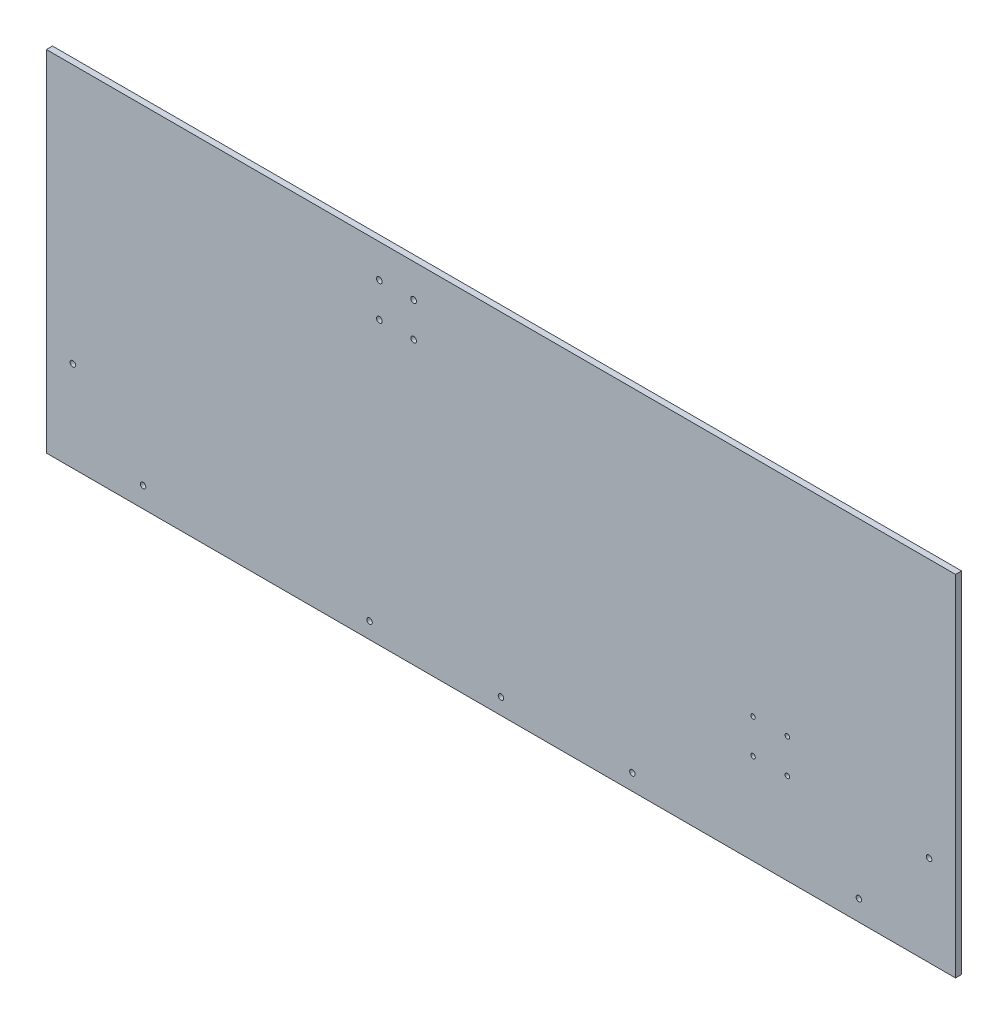
ISO-10303-21;
HEADER;
FILE_DESCRIPTION(('STEP AP214'),'2;1');
FILE_NAME('part.step','',(''),(''),'','','');
FILE_SCHEMA(('AUTOMOTIVE_DESIGN { 1 0 10303 214 1 1 1 1 }'));
ENDSEC;
DATA;
#1=APPLICATION_CONTEXT('core data for automotive mechanical design processes');
#2=APPLICATION_PROTOCOL_DEFINITION('international standard','automotive_design',2000,#1);
#3=PRODUCT_CONTEXT('',#1,'mechanical');
#4=PRODUCT('Part','Part','',(#3));
#5=PRODUCT_RELATED_PRODUCT_CATEGORY('part','',(#4));
#6=PRODUCT_DEFINITION_FORMATION('','',#4);
#7=PRODUCT_DEFINITION_CONTEXT('part definition',#1,'design');
#8=PRODUCT_DEFINITION('design','',#6,#7);
#9=PRODUCT_DEFINITION_SHAPE('','',#8);
#10=(LENGTH_UNIT() NAMED_UNIT(*) SI_UNIT(.MILLI.,.METRE.));
#11=(NAMED_UNIT(*) PLANE_ANGLE_UNIT() SI_UNIT($,.RADIAN.));
#12=(NAMED_UNIT(*) SI_UNIT($,.STERADIAN.) SOLID_ANGLE_UNIT());
#13=UNCERTAINTY_MEASURE_WITH_UNIT(LENGTH_MEASURE(1.E-05),#10,'distance_accuracy_value','');
#14=(GEOMETRIC_REPRESENTATION_CONTEXT(3) GLOBAL_UNCERTAINTY_ASSIGNED_CONTEXT((#13)) GLOBAL_UNIT_ASSIGNED_CONTEXT((#10,
#11,#12)) REPRESENTATION_CONTEXT('',''));
#15=CARTESIAN_POINT('',(0.,0.,0.));
#16=DIRECTION('',(0.,0.,1.));
#17=DIRECTION('',(1.,0.,0.));
#18=AXIS2_PLACEMENT_3D('',#15,#16,#17);
#19=CARTESIAN_POINT('',(357.1875,-137.31875,4.7625));
#20=DIRECTION('',(-1.,0.,0.));
#21=DIRECTION('',(0.,0.,1.));
#22=AXIS2_PLACEMENT_3D('',#19,#20,#21);
#23=PLANE('',#22);
#24=DIRECTION('',(0.,1.,0.));
#25=VECTOR('',#24,1.);
#26=CARTESIAN_POINT('',(357.1875,-137.31875,0.));
#27=LINE('',#26,#25);
#28=CARTESIAN_POINT('',(357.1875,-137.31875,0.));
#29=VERTEX_POINT('',#28);
#30=CARTESIAN_POINT('',(357.1875,137.31875,0.));
#31=VERTEX_POINT('',#30);
#32=EDGE_CURVE('E98',#29,#31,#27,.T.);
#33=ORIENTED_EDGE('',*,*,#32,.T.);
#34=DIRECTION('',(0.,0.,-1.));
#35=VECTOR('',#34,1.);
#36=CARTESIAN_POINT('',(357.1875,137.31875,4.7625));
#37=LINE('',#36,#35);
#38=CARTESIAN_POINT('',(357.1875,137.31875,4.7625));
#39=VERTEX_POINT('',#38);
#40=EDGE_CURVE('E11',#39,#31,#37,.T.);
#41=ORIENTED_EDGE('',*,*,#40,.F.);
#42=DIRECTION('',(0.,1.,0.));
#43=VECTOR('',#42,1.);
#44=CARTESIAN_POINT('',(357.1875,-137.31875,4.7625));
#45=LINE('',#44,#43);
#46=CARTESIAN_POINT('',(357.1875,-137.31875,4.7625));
#47=VERTEX_POINT('',#46);
#48=EDGE_CURVE('E85',#47,#39,#45,.T.);
#49=ORIENTED_EDGE('',*,*,#48,.F.);
#50=DIRECTION('',(0.,0.,-1.));
#51=VECTOR('',#50,1.);
#52=CARTESIAN_POINT('',(357.1875,-137.31875,4.7625));
#53=LINE('',#52,#51);
#54=EDGE_CURVE('E94',#47,#29,#53,.T.);
#55=ORIENTED_EDGE('',*,*,#54,.T.);
#56=EDGE_LOOP('',(#33,#41,#49,#55));
#57=FACE_BOUND('',#56,.T.);
#58=ADVANCED_FACE('F32',(#57),#23,.F.);
#59=CARTESIAN_POINT('',(-357.1875,137.31875,4.7625));
#60=DIRECTION('',(0.,-1.,0.));
#61=DIRECTION('',(0.,0.,-1.));
#62=AXIS2_PLACEMENT_3D('',#59,#60,#61);
#63=PLANE('',#62);
#64=DIRECTION('',(-1.,0.,0.));
#65=VECTOR('',#64,1.);
#66=CARTESIAN_POINT('',(-357.1875,137.31875,0.));
#67=LINE('',#66,#65);
#68=CARTESIAN_POINT('',(-357.1875,137.31875,0.));
#69=VERTEX_POINT('',#68);
#70=EDGE_CURVE('E89',#31,#69,#67,.T.);
#71=ORIENTED_EDGE('',*,*,#70,.T.);
#72=DIRECTION('',(0.,0.,-1.));
#73=VECTOR('',#72,1.);
#74=CARTESIAN_POINT('',(-357.1875,137.31875,4.7625));
#75=LINE('',#74,#73);
#76=CARTESIAN_POINT('',(-357.1875,137.31875,4.7625));
#77=VERTEX_POINT('',#76);
#78=EDGE_CURVE('E41',#77,#69,#75,.T.);
#79=ORIENTED_EDGE('',*,*,#78,.F.);
#80=DIRECTION('',(-1.,0.,0.));
#81=VECTOR('',#80,1.);
#82=CARTESIAN_POINT('',(-357.1875,137.31875,4.7625));
#83=LINE('',#82,#81);
#84=EDGE_CURVE('E80',#39,#77,#83,.T.);
#85=ORIENTED_EDGE('',*,*,#84,.F.);
#86=ORIENTED_EDGE('',*,*,#40,.T.);
#87=EDGE_LOOP('',(#71,#79,#85,#86));
#88=FACE_BOUND('',#87,.T.);
#89=ADVANCED_FACE('F88',(#88),#63,.F.);
#90=CARTESIAN_POINT('',(-357.1875,-137.31875,4.7625));
#91=DIRECTION('',(1.,0.,0.));
#92=DIRECTION('',(0.,0.,-1.));
#93=AXIS2_PLACEMENT_3D('',#90,#91,#92);
#94=PLANE('',#93);
#95=DIRECTION('',(0.,-1.,0.));
#96=VECTOR('',#95,1.);
#97=CARTESIAN_POINT('',(-357.1875,-137.31875,0.));
#98=LINE('',#97,#96);
#99=CARTESIAN_POINT('',(-357.1875,-137.31875,0.));
#100=VERTEX_POINT('',#99);
#101=EDGE_CURVE('E67',#69,#100,#98,.T.);
#102=ORIENTED_EDGE('',*,*,#101,.T.);
#103=DIRECTION('',(0.,0.,-1.));
#104=VECTOR('',#103,1.);
#105=CARTESIAN_POINT('',(-357.1875,-137.31875,4.7625));
#106=LINE('',#105,#104);
#107=CARTESIAN_POINT('',(-357.1875,-137.31875,4.7625));
#108=VERTEX_POINT('',#107);
#109=EDGE_CURVE('E90',#108,#100,#106,.T.);
#110=ORIENTED_EDGE('',*,*,#109,.F.);
#111=DIRECTION('',(0.,-1.,0.));
#112=VECTOR('',#111,1.);
#113=CARTESIAN_POINT('',(-357.1875,-137.31875,4.7625));
#114=LINE('',#113,#112);
#115=EDGE_CURVE('E83',#77,#108,#114,.T.);
#116=ORIENTED_EDGE('',*,*,#115,.F.);
#117=ORIENTED_EDGE('',*,*,#78,.T.);
#118=EDGE_LOOP('',(#102,#110,#116,#117));
#119=FACE_BOUND('',#118,.T.);
#120=ADVANCED_FACE('F92',(#119),#94,.F.);
#121=CARTESIAN_POINT('',(-357.1875,-137.31875,4.7625));
#122=DIRECTION('',(0.,1.,0.));
#123=DIRECTION('',(0.,0.,1.));
#124=AXIS2_PLACEMENT_3D('',#121,#122,#123);
#125=PLANE('',#124);
#126=DIRECTION('',(1.,0.,0.));
#127=VECTOR('',#126,1.);
#128=CARTESIAN_POINT('',(-357.1875,-137.31875,0.));
#129=LINE('',#128,#127);
#130=EDGE_CURVE('E73',#100,#29,#129,.T.);
#131=ORIENTED_EDGE('',*,*,#130,.T.);
#132=ORIENTED_EDGE('',*,*,#54,.F.);
#133=DIRECTION('',(1.,0.,0.));
#134=VECTOR('',#133,1.);
#135=CARTESIAN_POINT('',(-357.1875,-137.31875,4.7625));
#136=LINE('',#135,#134);
#137=EDGE_CURVE('E50',#108,#47,#136,.T.);
#138=ORIENTED_EDGE('',*,*,#137,.F.);
#139=ORIENTED_EDGE('',*,*,#109,.T.);
#140=EDGE_LOOP('',(#131,#132,#138,#139));
#141=FACE_BOUND('',#140,.T.);
#142=ADVANCED_FACE('F178',(#141),#125,.F.);
#143=CARTESIAN_POINT('',(0.,0.,4.7625));
#144=DIRECTION('',(0.,0.,-1.));
#145=DIRECTION('',(-1.,0.,0.));
#146=AXIS2_PLACEMENT_3D('',#143,#144,#145);
#147=PLANE('',#146);
#148=CARTESIAN_POINT('',(198.048115818396,-65.8896341816041,4.7625));
#149=DIRECTION('',(0.,0.,1.));
#150=DIRECTION('',(1.,0.,0.));
#151=AXIS2_PLACEMENT_3D('',#148,#149,#150);
#152=CIRCLE('',#151,1.77799999999998);
#153=CARTESIAN_POINT('',(199.826115818396,-65.8896341816041,4.7625));
#154=VERTEX_POINT('',#153);
#155=EDGE_CURVE('E368',#154,#154,#152,.T.);
#156=ORIENTED_EDGE('',*,*,#155,.F.);
#157=EDGE_LOOP('',(#156));
#158=FACE_BOUND('',#157,.T.);
#159=CARTESIAN_POINT('',(224.988884181604,-65.8896341816041,4.7625));
#160=DIRECTION('',(0.,0.,1.));
#161=DIRECTION('',(1.,0.,0.));
#162=AXIS2_PLACEMENT_3D('',#159,#160,#161);
#163=CIRCLE('',#162,1.778);
#164=CARTESIAN_POINT('',(226.766884181604,-65.8896341816041,4.7625));
#165=VERTEX_POINT('',#164);
#166=EDGE_CURVE('E370',#165,#165,#163,.T.);
#167=ORIENTED_EDGE('',*,*,#166,.F.);
#168=EDGE_LOOP('',(#167));
#169=FACE_BOUND('',#168,.T.);
#170=CARTESIAN_POINT('',(224.988884181604,-38.9488658183966,4.7625));
#171=DIRECTION('',(0.,0.,1.));
#172=DIRECTION('',(1.,0.,0.));
#173=AXIS2_PLACEMENT_3D('',#170,#171,#172);
#174=CIRCLE('',#173,1.778);
#175=CARTESIAN_POINT('',(226.766884181604,-38.9488658183966,4.7625));
#176=VERTEX_POINT('',#175);
#177=EDGE_CURVE('E376',#176,#176,#174,.T.);
#178=ORIENTED_EDGE('',*,*,#177,.F.);
#179=EDGE_LOOP('',(#178));
#180=FACE_BOUND('',#179,.T.);
#181=CARTESIAN_POINT('',(198.048115818396,-38.9488658183968,4.7625));
#182=DIRECTION('',(0.,0.,1.));
#183=DIRECTION('',(1.,0.,0.));
#184=AXIS2_PLACEMENT_3D('',#181,#182,#183);
#185=CIRCLE('',#184,1.77799999999998);
#186=CARTESIAN_POINT('',(199.826115818396,-38.9488658183968,4.7625));
#187=VERTEX_POINT('',#186);
#188=EDGE_CURVE('E382',#187,#187,#185,.T.);
#189=ORIENTED_EDGE('',*,*,#188,.F.);
#190=EDGE_LOOP('',(#189));
#191=FACE_BOUND('',#190,.T.);
#192=CARTESIAN_POINT('',(-95.5675,111.15675,4.7625));
#193=DIRECTION('',(0.,0.,1.));
#194=DIRECTION('',(1.,0.,0.));
#195=AXIS2_PLACEMENT_3D('',#192,#193,#194);
#196=CIRCLE('',#195,2.2479);
#197=CARTESIAN_POINT('',(-93.3196,111.15675,4.7625));
#198=VERTEX_POINT('',#197);
#199=EDGE_CURVE('E388',#198,#198,#196,.T.);
#200=ORIENTED_EDGE('',*,*,#199,.F.);
#201=EDGE_LOOP('',(#200));
#202=FACE_BOUND('',#201,.T.);
#203=CARTESIAN_POINT('',(-68.6435,111.15675,4.7625));
#204=DIRECTION('',(0.,0.,1.));
#205=DIRECTION('',(1.,0.,0.));
#206=AXIS2_PLACEMENT_3D('',#203,#204,#205);
#207=CIRCLE('',#206,2.2479);
#208=CARTESIAN_POINT('',(-66.3956,111.15675,4.7625));
#209=VERTEX_POINT('',#208);
#210=EDGE_CURVE('E133',#209,#209,#207,.T.);
#211=ORIENTED_EDGE('',*,*,#210,.F.);
#212=EDGE_LOOP('',(#211));
#213=FACE_BOUND('',#212,.T.);
#214=CARTESIAN_POINT('',(-95.5675,84.23275,4.7625));
#215=DIRECTION('',(0.,0.,1.));
#216=DIRECTION('',(1.,0.,0.));
#217=AXIS2_PLACEMENT_3D('',#214,#215,#216);
#218=CIRCLE('',#217,2.2479);
#219=CARTESIAN_POINT('',(-93.3196,84.23275,4.7625));
#220=VERTEX_POINT('',#219);
#221=EDGE_CURVE('E122',#220,#220,#218,.T.);
#222=ORIENTED_EDGE('',*,*,#221,.F.);
#223=EDGE_LOOP('',(#222));
#224=FACE_BOUND('',#223,.T.);
#225=CARTESIAN_POINT('',(-68.6435,84.23275,4.7625));
#226=DIRECTION('',(0.,0.,1.));
#227=DIRECTION('',(1.,0.,0.));
#228=AXIS2_PLACEMENT_3D('',#225,#226,#227);
#229=CIRCLE('',#228,2.2479);
#230=CARTESIAN_POINT('',(-66.3956,84.23275,4.7625));
#231=VERTEX_POINT('',#230);
#232=EDGE_CURVE('E121',#231,#231,#229,.T.);
#233=ORIENTED_EDGE('',*,*,#232,.F.);
#234=EDGE_LOOP('',(#233));
#235=FACE_BOUND('',#234,.T.);
#236=CARTESIAN_POINT('',(-103.251,-124.61875,4.7625));
#237=DIRECTION('',(0.,0.,1.));
#238=DIRECTION('',(1.,0.,0.));
#239=AXIS2_PLACEMENT_3D('',#236,#237,#238);
#240=CIRCLE('',#239,2.15264999999999);
#241=CARTESIAN_POINT('',(-101.09835,-124.61875,4.7625));
#242=VERTEX_POINT('',#241);
#243=EDGE_CURVE('E139',#242,#242,#240,.T.);
#244=ORIENTED_EDGE('',*,*,#243,.F.);
#245=EDGE_LOOP('',(#244));
#246=FACE_BOUND('',#245,.T.);
#247=CARTESIAN_POINT('',(0.,-124.61875,4.7625));
#248=DIRECTION('',(0.,0.,1.));
#249=DIRECTION('',(1.,0.,0.));
#250=AXIS2_PLACEMENT_3D('',#247,#248,#249);
#251=CIRCLE('',#250,2.15264999999999);
#252=CARTESIAN_POINT('',(2.15264999999999,-124.61875,4.7625));
#253=VERTEX_POINT('',#252);
#254=EDGE_CURVE('E145',#253,#253,#251,.T.);
#255=ORIENTED_EDGE('',*,*,#254,.F.);
#256=EDGE_LOOP('',(#255));
#257=FACE_BOUND('',#256,.T.);
#258=CARTESIAN_POINT('',(103.251,-124.61875,4.7625));
#259=DIRECTION('',(0.,0.,1.));
#260=DIRECTION('',(1.,0.,0.));
#261=AXIS2_PLACEMENT_3D('',#258,#259,#260);
#262=CIRCLE('',#261,2.15264999999999);
#263=CARTESIAN_POINT('',(105.40365,-124.61875,4.7625));
#264=VERTEX_POINT('',#263);
#265=EDGE_CURVE('E151',#264,#264,#262,.T.);
#266=ORIENTED_EDGE('',*,*,#265,.F.);
#267=EDGE_LOOP('',(#266));
#268=FACE_BOUND('',#267,.T.);
#269=CARTESIAN_POINT('',(-336.41538,-66.13271,4.7625));
#270=DIRECTION('',(0.,0.,1.));
#271=DIRECTION('',(1.,0.,0.));
#272=AXIS2_PLACEMENT_3D('',#269,#270,#271);
#273=CIRCLE('',#272,2.15264999999998);
#274=CARTESIAN_POINT('',(-334.26273,-66.13271,4.7625));
#275=VERTEX_POINT('',#274);
#276=EDGE_CURVE('E118',#275,#275,#273,.T.);
#277=ORIENTED_EDGE('',*,*,#276,.F.);
#278=EDGE_LOOP('',(#277));
#279=FACE_BOUND('',#278,.T.);
#280=CARTESIAN_POINT('',(-281.23896,-121.30913,4.7625));
#281=DIRECTION('',(0.,0.,1.));
#282=DIRECTION('',(1.,0.,0.));
#283=AXIS2_PLACEMENT_3D('',#280,#281,#282);
#284=CIRCLE('',#283,2.15264999999998);
#285=CARTESIAN_POINT('',(-279.08631,-121.30913,4.7625));
#286=VERTEX_POINT('',#285);
#287=EDGE_CURVE('E115',#286,#286,#284,.T.);
#288=ORIENTED_EDGE('',*,*,#287,.F.);
#289=EDGE_LOOP('',(#288));
#290=FACE_BOUND('',#289,.T.);
#291=CARTESIAN_POINT('',(281.23896,-121.30913,4.7625));
#292=DIRECTION('',(0.,0.,1.));
#293=DIRECTION('',(1.,0.,0.));
#294=AXIS2_PLACEMENT_3D('',#291,#292,#293);
#295=CIRCLE('',#294,2.15264999999998);
#296=CARTESIAN_POINT('',(283.39161,-121.30913,4.7625));
#297=VERTEX_POINT('',#296);
#298=EDGE_CURVE('E111',#297,#297,#295,.T.);
#299=ORIENTED_EDGE('',*,*,#298,.F.);
#300=EDGE_LOOP('',(#299));
#301=FACE_BOUND('',#300,.T.);
#302=CARTESIAN_POINT('',(336.41538,-66.13271,4.7625));
#303=DIRECTION('',(0.,0.,1.));
#304=DIRECTION('',(1.,0.,0.));
#305=AXIS2_PLACEMENT_3D('',#302,#303,#304);
#306=CIRCLE('',#305,2.15264999999998);
#307=CARTESIAN_POINT('',(338.56803,-66.13271,4.7625));
#308=VERTEX_POINT('',#307);
#309=EDGE_CURVE('E110',#308,#308,#306,.T.);
#310=ORIENTED_EDGE('',*,*,#309,.F.);
#311=EDGE_LOOP('',(#310));
#312=FACE_BOUND('',#311,.T.);
#313=ORIENTED_EDGE('',*,*,#48,.T.);
#314=ORIENTED_EDGE('',*,*,#84,.T.);
#315=ORIENTED_EDGE('',*,*,#115,.T.);
#316=ORIENTED_EDGE('',*,*,#137,.T.);
#317=EDGE_LOOP('',(#313,#314,#315,#316));
#318=FACE_BOUND('',#317,.T.);
#319=ADVANCED_FACE('F81',(#158,#169,#180,#191,#202,#213,#224,#235,#246,#257,#268,#279,#290,#301,
#312,#318),#147,.F.);
#320=CARTESIAN_POINT('',(0.,0.,0.));
#321=DIRECTION('',(0.,0.,-1.));
#322=DIRECTION('',(-1.,0.,0.));
#323=AXIS2_PLACEMENT_3D('',#320,#321,#322);
#324=PLANE('',#323);
#325=CARTESIAN_POINT('',(198.048115818396,-65.8896341816041,0.));
#326=DIRECTION('',(0.,0.,1.));
#327=DIRECTION('',(1.,0.,0.));
#328=AXIS2_PLACEMENT_3D('',#325,#326,#327);
#329=CIRCLE('',#328,1.77799999999998);
#330=CARTESIAN_POINT('',(199.826115818396,-65.8896341816041,0.));
#331=VERTEX_POINT('',#330);
#332=EDGE_CURVE('E365',#331,#331,#329,.T.);
#333=ORIENTED_EDGE('',*,*,#332,.T.);
#334=EDGE_LOOP('',(#333));
#335=FACE_BOUND('',#334,.T.);
#336=CARTESIAN_POINT('',(224.988884181604,-65.8896341816041,0.));
#337=DIRECTION('',(0.,0.,1.));
#338=DIRECTION('',(1.,0.,0.));
#339=AXIS2_PLACEMENT_3D('',#336,#337,#338);
#340=CIRCLE('',#339,1.778);
#341=CARTESIAN_POINT('',(226.766884181604,-65.8896341816041,0.));
#342=VERTEX_POINT('',#341);
#343=EDGE_CURVE('E373',#342,#342,#340,.T.);
#344=ORIENTED_EDGE('',*,*,#343,.T.);
#345=EDGE_LOOP('',(#344));
#346=FACE_BOUND('',#345,.T.);
#347=CARTESIAN_POINT('',(224.988884181604,-38.9488658183966,0.));
#348=DIRECTION('',(0.,0.,1.));
#349=DIRECTION('',(1.,0.,0.));
#350=AXIS2_PLACEMENT_3D('',#347,#348,#349);
#351=CIRCLE('',#350,1.778);
#352=CARTESIAN_POINT('',(226.766884181604,-38.9488658183966,0.));
#353=VERTEX_POINT('',#352);
#354=EDGE_CURVE('E379',#353,#353,#351,.T.);
#355=ORIENTED_EDGE('',*,*,#354,.T.);
#356=EDGE_LOOP('',(#355));
#357=FACE_BOUND('',#356,.T.);
#358=CARTESIAN_POINT('',(198.048115818396,-38.9488658183968,0.));
#359=DIRECTION('',(0.,0.,1.));
#360=DIRECTION('',(1.,0.,0.));
#361=AXIS2_PLACEMENT_3D('',#358,#359,#360);
#362=CIRCLE('',#361,1.77799999999998);
#363=CARTESIAN_POINT('',(199.826115818396,-38.9488658183968,0.));
#364=VERTEX_POINT('',#363);
#365=EDGE_CURVE('E385',#364,#364,#362,.T.);
#366=ORIENTED_EDGE('',*,*,#365,.T.);
#367=EDGE_LOOP('',(#366));
#368=FACE_BOUND('',#367,.T.);
#369=CARTESIAN_POINT('',(-95.5675,111.15675,0.));
#370=DIRECTION('',(0.,0.,-1.));
#371=DIRECTION('',(-1.,0.,0.));
#372=AXIS2_PLACEMENT_3D('',#369,#370,#371);
#373=CIRCLE('',#372,2.24789999999999);
#374=CARTESIAN_POINT('',(-97.8154,111.15675,0.));
#375=VERTEX_POINT('',#374);
#376=EDGE_CURVE('E392',#375,#375,#373,.T.);
#377=ORIENTED_EDGE('',*,*,#376,.F.);
#378=EDGE_LOOP('',(#377));
#379=FACE_BOUND('',#378,.T.);
#380=CARTESIAN_POINT('',(-68.6435,111.15675,0.));
#381=DIRECTION('',(0.,0.,-1.));
#382=DIRECTION('',(-1.,0.,0.));
#383=AXIS2_PLACEMENT_3D('',#380,#381,#382);
#384=CIRCLE('',#383,2.24789999999999);
#385=CARTESIAN_POINT('',(-70.8914,111.15675,0.));
#386=VERTEX_POINT('',#385);
#387=EDGE_CURVE('E35',#386,#386,#384,.T.);
#388=ORIENTED_EDGE('',*,*,#387,.F.);
#389=EDGE_LOOP('',(#388));
#390=FACE_BOUND('',#389,.T.);
#391=CARTESIAN_POINT('',(-95.5675,84.23275,0.));
#392=DIRECTION('',(0.,0.,-1.));
#393=DIRECTION('',(-1.,0.,0.));
#394=AXIS2_PLACEMENT_3D('',#391,#392,#393);
#395=CIRCLE('',#394,2.24789999999999);
#396=CARTESIAN_POINT('',(-97.8154,84.23275,0.));
#397=VERTEX_POINT('',#396);
#398=EDGE_CURVE('E119',#397,#397,#395,.T.);
#399=ORIENTED_EDGE('',*,*,#398,.F.);
#400=EDGE_LOOP('',(#399));
#401=FACE_BOUND('',#400,.T.);
#402=CARTESIAN_POINT('',(-68.6435,84.23275,0.));
#403=DIRECTION('',(0.,0.,-1.));
#404=DIRECTION('',(-1.,0.,0.));
#405=AXIS2_PLACEMENT_3D('',#402,#403,#404);
#406=CIRCLE('',#405,2.24789999999999);
#407=CARTESIAN_POINT('',(-70.8914,84.23275,0.));
#408=VERTEX_POINT('',#407);
#409=EDGE_CURVE('E126',#408,#408,#406,.T.);
#410=ORIENTED_EDGE('',*,*,#409,.F.);
#411=EDGE_LOOP('',(#410));
#412=FACE_BOUND('',#411,.T.);
#413=CARTESIAN_POINT('',(-103.251,-124.61875,0.));
#414=DIRECTION('',(0.,0.,-1.));
#415=DIRECTION('',(-1.,0.,0.));
#416=AXIS2_PLACEMENT_3D('',#413,#414,#415);
#417=CIRCLE('',#416,2.15264999999999);
#418=CARTESIAN_POINT('',(-105.40365,-124.61875,0.));
#419=VERTEX_POINT('',#418);
#420=EDGE_CURVE('E142',#419,#419,#417,.T.);
#421=ORIENTED_EDGE('',*,*,#420,.F.);
#422=EDGE_LOOP('',(#421));
#423=FACE_BOUND('',#422,.T.);
#424=CARTESIAN_POINT('',(0.,-124.61875,0.));
#425=DIRECTION('',(0.,0.,-1.));
#426=DIRECTION('',(-1.,0.,0.));
#427=AXIS2_PLACEMENT_3D('',#424,#425,#426);
#428=CIRCLE('',#427,2.15264999999999);
#429=CARTESIAN_POINT('',(-2.15264999999999,-124.61875,0.));
#430=VERTEX_POINT('',#429);
#431=EDGE_CURVE('E148',#430,#430,#428,.T.);
#432=ORIENTED_EDGE('',*,*,#431,.F.);
#433=EDGE_LOOP('',(#432));
#434=FACE_BOUND('',#433,.T.);
#435=CARTESIAN_POINT('',(103.251,-124.61875,0.));
#436=DIRECTION('',(0.,0.,-1.));
#437=DIRECTION('',(-1.,0.,0.));
#438=AXIS2_PLACEMENT_3D('',#435,#436,#437);
#439=CIRCLE('',#438,2.15264999999999);
#440=CARTESIAN_POINT('',(101.09835,-124.61875,0.));
#441=VERTEX_POINT('',#440);
#442=EDGE_CURVE('E154',#441,#441,#439,.T.);
#443=ORIENTED_EDGE('',*,*,#442,.F.);
#444=EDGE_LOOP('',(#443));
#445=FACE_BOUND('',#444,.T.);
#446=CARTESIAN_POINT('',(-336.41538,-66.13271,0.));
#447=DIRECTION('',(0.,0.,-1.));
#448=DIRECTION('',(-1.,0.,0.));
#449=AXIS2_PLACEMENT_3D('',#446,#447,#448);
#450=CIRCLE('',#449,2.15264999999998);
#451=CARTESIAN_POINT('',(-338.56803,-66.13271,0.));
#452=VERTEX_POINT('',#451);
#453=EDGE_CURVE('E116',#452,#452,#450,.T.);
#454=ORIENTED_EDGE('',*,*,#453,.F.);
#455=EDGE_LOOP('',(#454));
#456=FACE_BOUND('',#455,.T.);
#457=CARTESIAN_POINT('',(-281.23896,-121.30913,0.));
#458=DIRECTION('',(0.,0.,-1.));
#459=DIRECTION('',(-1.,0.,0.));
#460=AXIS2_PLACEMENT_3D('',#457,#458,#459);
#461=CIRCLE('',#460,2.15264999999998);
#462=CARTESIAN_POINT('',(-283.39161,-121.30913,0.));
#463=VERTEX_POINT('',#462);
#464=EDGE_CURVE('E112',#463,#463,#461,.T.);
#465=ORIENTED_EDGE('',*,*,#464,.F.);
#466=EDGE_LOOP('',(#465));
#467=FACE_BOUND('',#466,.T.);
#468=CARTESIAN_POINT('',(281.23896,-121.30913,0.));
#469=DIRECTION('',(0.,0.,-1.));
#470=DIRECTION('',(-1.,0.,0.));
#471=AXIS2_PLACEMENT_3D('',#468,#469,#470);
#472=CIRCLE('',#471,2.15264999999998);
#473=CARTESIAN_POINT('',(279.08631,-121.30913,0.));
#474=VERTEX_POINT('',#473);
#475=EDGE_CURVE('E107',#474,#474,#472,.T.);
#476=ORIENTED_EDGE('',*,*,#475,.F.);
#477=EDGE_LOOP('',(#476));
#478=FACE_BOUND('',#477,.T.);
#479=CARTESIAN_POINT('',(336.41538,-66.13271,0.));
#480=DIRECTION('',(0.,0.,-1.));
#481=DIRECTION('',(-1.,0.,0.));
#482=AXIS2_PLACEMENT_3D('',#479,#480,#481);
#483=CIRCLE('',#482,2.15264999999998);
#484=CARTESIAN_POINT('',(334.26273,-66.13271,0.));
#485=VERTEX_POINT('',#484);
#486=EDGE_CURVE('E101',#485,#485,#483,.T.);
#487=ORIENTED_EDGE('',*,*,#486,.F.);
#488=EDGE_LOOP('',(#487));
#489=FACE_BOUND('',#488,.T.);
#490=ORIENTED_EDGE('',*,*,#32,.F.);
#491=ORIENTED_EDGE('',*,*,#130,.F.);
#492=ORIENTED_EDGE('',*,*,#101,.F.);
#493=ORIENTED_EDGE('',*,*,#70,.F.);
#494=EDGE_LOOP('',(#490,#491,#492,#493));
#495=FACE_BOUND('',#494,.T.);
#496=ADVANCED_FACE('F171',(#335,#346,#357,#368,#379,#390,#401,#412,#423,#434,#445,#456,#467,
#478,#489,#495),#324,.T.);
#497=CARTESIAN_POINT('',(336.41538,-66.13271,4.7625));
#498=DIRECTION('',(0.,0.,1.));
#499=DIRECTION('',(1.,0.,0.));
#500=AXIS2_PLACEMENT_3D('',#497,#498,#499);
#501=CYLINDRICAL_SURFACE('',#500,2.15264999999998);
#502=ORIENTED_EDGE('',*,*,#486,.T.);
#503=EDGE_LOOP('',(#502));
#504=FACE_BOUND('',#503,.T.);
#505=ORIENTED_EDGE('',*,*,#309,.T.);
#506=EDGE_LOOP('',(#505));
#507=FACE_BOUND('',#506,.T.);
#508=ADVANCED_FACE('F168',(#504,#507),#501,.F.);
#509=CARTESIAN_POINT('',(281.23896,-121.30913,4.7625));
#510=DIRECTION('',(0.,0.,1.));
#511=DIRECTION('',(1.,0.,0.));
#512=AXIS2_PLACEMENT_3D('',#509,#510,#511);
#513=CYLINDRICAL_SURFACE('',#512,2.15264999999998);
#514=ORIENTED_EDGE('',*,*,#475,.T.);
#515=EDGE_LOOP('',(#514));
#516=FACE_BOUND('',#515,.T.);
#517=ORIENTED_EDGE('',*,*,#298,.T.);
#518=EDGE_LOOP('',(#517));
#519=FACE_BOUND('',#518,.T.);
#520=ADVANCED_FACE('F213',(#516,#519),#513,.F.);
#521=CARTESIAN_POINT('',(-281.23896,-121.30913,4.7625));
#522=DIRECTION('',(0.,0.,1.));
#523=DIRECTION('',(1.,0.,0.));
#524=AXIS2_PLACEMENT_3D('',#521,#522,#523);
#525=CYLINDRICAL_SURFACE('',#524,2.15264999999998);
#526=ORIENTED_EDGE('',*,*,#464,.T.);
#527=EDGE_LOOP('',(#526));
#528=FACE_BOUND('',#527,.T.);
#529=ORIENTED_EDGE('',*,*,#287,.T.);
#530=EDGE_LOOP('',(#529));
#531=FACE_BOUND('',#530,.T.);
#532=ADVANCED_FACE('F224',(#528,#531),#525,.F.);
#533=CARTESIAN_POINT('',(-336.41538,-66.13271,4.7625));
#534=DIRECTION('',(0.,0.,1.));
#535=DIRECTION('',(1.,0.,0.));
#536=AXIS2_PLACEMENT_3D('',#533,#534,#535);
#537=CYLINDRICAL_SURFACE('',#536,2.15264999999998);
#538=ORIENTED_EDGE('',*,*,#453,.T.);
#539=EDGE_LOOP('',(#538));
#540=FACE_BOUND('',#539,.T.);
#541=ORIENTED_EDGE('',*,*,#276,.T.);
#542=EDGE_LOOP('',(#541));
#543=FACE_BOUND('',#542,.T.);
#544=ADVANCED_FACE('F234',(#540,#543),#537,.F.);
#545=CARTESIAN_POINT('',(103.251,-124.61875,4.7625));
#546=DIRECTION('',(0.,0.,1.));
#547=DIRECTION('',(1.,0.,0.));
#548=AXIS2_PLACEMENT_3D('',#545,#546,#547);
#549=CYLINDRICAL_SURFACE('',#548,2.15264999999999);
#550=ORIENTED_EDGE('',*,*,#442,.T.);
#551=EDGE_LOOP('',(#550));
#552=FACE_BOUND('',#551,.T.);
#553=ORIENTED_EDGE('',*,*,#265,.T.);
#554=EDGE_LOOP('',(#553));
#555=FACE_BOUND('',#554,.T.);
#556=ADVANCED_FACE('F244',(#552,#555),#549,.F.);
#557=CARTESIAN_POINT('',(0.,-124.61875,4.7625));
#558=DIRECTION('',(0.,0.,1.));
#559=DIRECTION('',(1.,0.,0.));
#560=AXIS2_PLACEMENT_3D('',#557,#558,#559);
#561=CYLINDRICAL_SURFACE('',#560,2.15264999999999);
#562=ORIENTED_EDGE('',*,*,#431,.T.);
#563=EDGE_LOOP('',(#562));
#564=FACE_BOUND('',#563,.T.);
#565=ORIENTED_EDGE('',*,*,#254,.T.);
#566=EDGE_LOOP('',(#565));
#567=FACE_BOUND('',#566,.T.);
#568=ADVANCED_FACE('F254',(#564,#567),#561,.F.);
#569=CARTESIAN_POINT('',(-103.251,-124.61875,4.7625));
#570=DIRECTION('',(0.,0.,1.));
#571=DIRECTION('',(1.,0.,0.));
#572=AXIS2_PLACEMENT_3D('',#569,#570,#571);
#573=CYLINDRICAL_SURFACE('',#572,2.15264999999999);
#574=ORIENTED_EDGE('',*,*,#420,.T.);
#575=EDGE_LOOP('',(#574));
#576=FACE_BOUND('',#575,.T.);
#577=ORIENTED_EDGE('',*,*,#243,.T.);
#578=EDGE_LOOP('',(#577));
#579=FACE_BOUND('',#578,.T.);
#580=ADVANCED_FACE('F264',(#576,#579),#573,.F.);
#581=CARTESIAN_POINT('',(-68.6435,84.23275,4.7625));
#582=DIRECTION('',(0.,0.,1.));
#583=DIRECTION('',(1.,0.,0.));
#584=AXIS2_PLACEMENT_3D('',#581,#582,#583);
#585=CYLINDRICAL_SURFACE('',#584,2.24789999999999);
#586=ORIENTED_EDGE('',*,*,#409,.T.);
#587=EDGE_LOOP('',(#586));
#588=FACE_BOUND('',#587,.T.);
#589=ORIENTED_EDGE('',*,*,#232,.T.);
#590=EDGE_LOOP('',(#589));
#591=FACE_BOUND('',#590,.T.);
#592=ADVANCED_FACE('F274',(#588,#591),#585,.F.);
#593=CARTESIAN_POINT('',(-95.5675,84.23275,4.7625));
#594=DIRECTION('',(0.,0.,1.));
#595=DIRECTION('',(1.,0.,0.));
#596=AXIS2_PLACEMENT_3D('',#593,#594,#595);
#597=CYLINDRICAL_SURFACE('',#596,2.24789999999999);
#598=ORIENTED_EDGE('',*,*,#398,.T.);
#599=EDGE_LOOP('',(#598));
#600=FACE_BOUND('',#599,.T.);
#601=ORIENTED_EDGE('',*,*,#221,.T.);
#602=EDGE_LOOP('',(#601));
#603=FACE_BOUND('',#602,.T.);
#604=ADVANCED_FACE('F284',(#600,#603),#597,.F.);
#605=CARTESIAN_POINT('',(-68.6435,111.15675,4.7625));
#606=DIRECTION('',(0.,0.,1.));
#607=DIRECTION('',(1.,0.,0.));
#608=AXIS2_PLACEMENT_3D('',#605,#606,#607);
#609=CYLINDRICAL_SURFACE('',#608,2.24789999999999);
#610=ORIENTED_EDGE('',*,*,#387,.T.);
#611=EDGE_LOOP('',(#610));
#612=FACE_BOUND('',#611,.T.);
#613=ORIENTED_EDGE('',*,*,#210,.T.);
#614=EDGE_LOOP('',(#613));
#615=FACE_BOUND('',#614,.T.);
#616=ADVANCED_FACE('F294',(#612,#615),#609,.F.);
#617=CARTESIAN_POINT('',(-95.5675,111.15675,4.7625));
#618=DIRECTION('',(0.,0.,1.));
#619=DIRECTION('',(1.,0.,0.));
#620=AXIS2_PLACEMENT_3D('',#617,#618,#619);
#621=CYLINDRICAL_SURFACE('',#620,2.24789999999999);
#622=ORIENTED_EDGE('',*,*,#376,.T.);
#623=EDGE_LOOP('',(#622));
#624=FACE_BOUND('',#623,.T.);
#625=ORIENTED_EDGE('',*,*,#199,.T.);
#626=EDGE_LOOP('',(#625));
#627=FACE_BOUND('',#626,.T.);
#628=ADVANCED_FACE('F303',(#624,#627),#621,.F.);
#629=CARTESIAN_POINT('',(198.048115818396,-38.9488658183968,0.));
#630=DIRECTION('',(0.,0.,1.));
#631=DIRECTION('',(1.,0.,0.));
#632=AXIS2_PLACEMENT_3D('',#629,#630,#631);
#633=CYLINDRICAL_SURFACE('',#632,1.77799999999998);
#634=ORIENTED_EDGE('',*,*,#365,.F.);
#635=EDGE_LOOP('',(#634));
#636=FACE_BOUND('',#635,.T.);
#637=ORIENTED_EDGE('',*,*,#188,.T.);
#638=EDGE_LOOP('',(#637));
#639=FACE_BOUND('',#638,.T.);
#640=ADVANCED_FACE('F312',(#636,#639),#633,.F.);
#641=CARTESIAN_POINT('',(224.988884181604,-38.9488658183966,0.));
#642=DIRECTION('',(0.,0.,1.));
#643=DIRECTION('',(1.,0.,0.));
#644=AXIS2_PLACEMENT_3D('',#641,#642,#643);
#645=CYLINDRICAL_SURFACE('',#644,1.778);
#646=ORIENTED_EDGE('',*,*,#354,.F.);
#647=EDGE_LOOP('',(#646));
#648=FACE_BOUND('',#647,.T.);
#649=ORIENTED_EDGE('',*,*,#177,.T.);
#650=EDGE_LOOP('',(#649));
#651=FACE_BOUND('',#650,.T.);
#652=ADVANCED_FACE('F328',(#648,#651),#645,.F.);
#653=CARTESIAN_POINT('',(224.988884181604,-65.8896341816041,0.));
#654=DIRECTION('',(0.,0.,1.));
#655=DIRECTION('',(1.,0.,0.));
#656=AXIS2_PLACEMENT_3D('',#653,#654,#655);
#657=CYLINDRICAL_SURFACE('',#656,1.778);
#658=ORIENTED_EDGE('',*,*,#343,.F.);
#659=EDGE_LOOP('',(#658));
#660=FACE_BOUND('',#659,.T.);
#661=ORIENTED_EDGE('',*,*,#166,.T.);
#662=EDGE_LOOP('',(#661));
#663=FACE_BOUND('',#662,.T.);
#664=ADVANCED_FACE('F338',(#660,#663),#657,.F.);
#665=CARTESIAN_POINT('',(198.048115818396,-65.8896341816041,0.));
#666=DIRECTION('',(0.,0.,1.));
#667=DIRECTION('',(1.,0.,0.));
#668=AXIS2_PLACEMENT_3D('',#665,#666,#667);
#669=CYLINDRICAL_SURFACE('',#668,1.77799999999998);
#670=ORIENTED_EDGE('',*,*,#332,.F.);
#671=EDGE_LOOP('',(#670));
#672=FACE_BOUND('',#671,.T.);
#673=ORIENTED_EDGE('',*,*,#155,.T.);
#674=EDGE_LOOP('',(#673));
#675=FACE_BOUND('',#674,.T.);
#676=ADVANCED_FACE('F348',(#672,#675),#669,.F.);
#677=CLOSED_SHELL('',(#58,#89,#120,#142,#319,#496,#508,#520,#532,#544,#556,#568,#580,#592,#604,
#616,#628,#640,#652,#664,#676));
#678=MANIFOLD_SOLID_BREP('B2',#677);
#679=ADVANCED_BREP_SHAPE_REPRESENTATION('',(#18,#678),#14);
#680=SHAPE_DEFINITION_REPRESENTATION(#9,#679);
ENDSEC;
END-ISO-10303-21;
